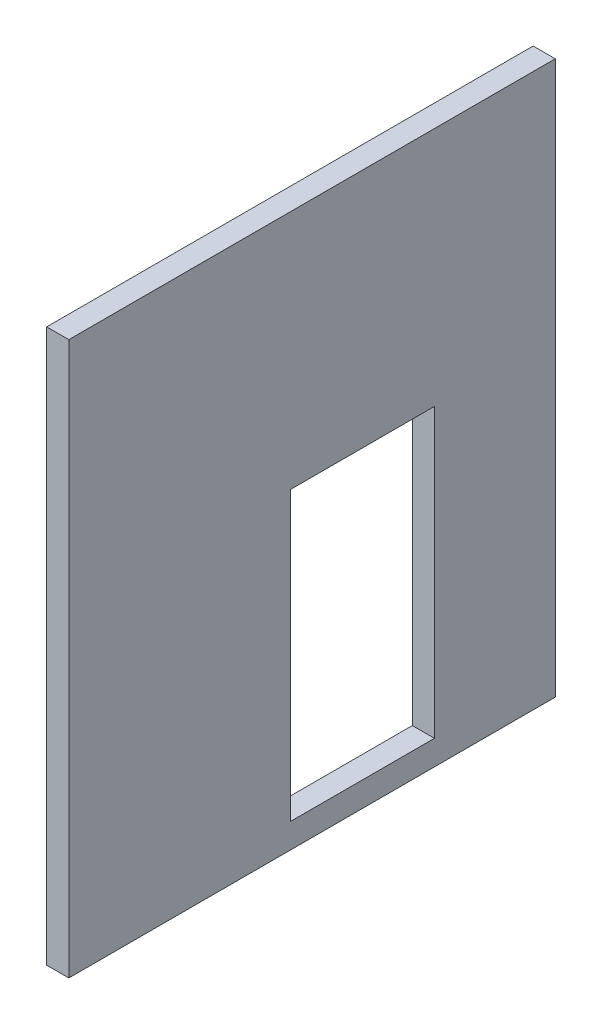
ISO-10303-21;
HEADER;
FILE_DESCRIPTION(('STEP AP214'),'2;1');
FILE_NAME('part.step','',(''),(''),'','','');
FILE_SCHEMA(('AUTOMOTIVE_DESIGN { 1 0 10303 214 1 1 1 1 }'));
ENDSEC;
DATA;
#1=APPLICATION_CONTEXT('core data for automotive mechanical design processes');
#2=APPLICATION_PROTOCOL_DEFINITION('international standard','automotive_design',2000,#1);
#3=PRODUCT_CONTEXT('',#1,'mechanical');
#4=PRODUCT('Part','Part','',(#3));
#5=PRODUCT_RELATED_PRODUCT_CATEGORY('part','',(#4));
#6=PRODUCT_DEFINITION_FORMATION('','',#4);
#7=PRODUCT_DEFINITION_CONTEXT('part definition',#1,'design');
#8=PRODUCT_DEFINITION('design','',#6,#7);
#9=PRODUCT_DEFINITION_SHAPE('','',#8);
#10=(LENGTH_UNIT() NAMED_UNIT(*) SI_UNIT(.MILLI.,.METRE.));
#11=(NAMED_UNIT(*) PLANE_ANGLE_UNIT() SI_UNIT($,.RADIAN.));
#12=(NAMED_UNIT(*) SI_UNIT($,.STERADIAN.) SOLID_ANGLE_UNIT());
#13=UNCERTAINTY_MEASURE_WITH_UNIT(LENGTH_MEASURE(1.E-05),#10,'distance_accuracy_value','');
#14=(GEOMETRIC_REPRESENTATION_CONTEXT(3) GLOBAL_UNCERTAINTY_ASSIGNED_CONTEXT((#13)) GLOBAL_UNIT_ASSIGNED_CONTEXT((#10,
#11,#12)) REPRESENTATION_CONTEXT('',''));
#15=CARTESIAN_POINT('',(0.,0.,0.));
#16=DIRECTION('',(0.,0.,1.));
#17=DIRECTION('',(1.,0.,0.));
#18=AXIS2_PLACEMENT_3D('',#15,#16,#17);
#19=CARTESIAN_POINT('',(20.,-250.,-220.));
#20=DIRECTION('',(0.,0.,1.));
#21=DIRECTION('',(1.,0.,0.));
#22=AXIS2_PLACEMENT_3D('',#19,#20,#21);
#23=PLANE('',#22);
#24=DIRECTION('',(0.,1.,0.));
#25=VECTOR('',#24,1.);
#26=CARTESIAN_POINT('',(0.,-250.,-220.));
#27=LINE('',#26,#25);
#28=CARTESIAN_POINT('',(0.,-250.,-220.));
#29=VERTEX_POINT('',#28);
#30=CARTESIAN_POINT('',(0.,250.,-220.));
#31=VERTEX_POINT('',#30);
#32=EDGE_CURVE('E134',#29,#31,#27,.T.);
#33=ORIENTED_EDGE('',*,*,#32,.T.);
#34=DIRECTION('',(-1.,0.,0.));
#35=VECTOR('',#34,1.);
#36=CARTESIAN_POINT('',(20.,250.,-220.));
#37=LINE('',#36,#35);
#38=CARTESIAN_POINT('',(20.,250.,-220.));
#39=VERTEX_POINT('',#38);
#40=EDGE_CURVE('E11',#39,#31,#37,.T.);
#41=ORIENTED_EDGE('',*,*,#40,.F.);
#42=DIRECTION('',(0.,1.,0.));
#43=VECTOR('',#42,1.);
#44=CARTESIAN_POINT('',(20.,-250.,-220.));
#45=LINE('',#44,#43);
#46=CARTESIAN_POINT('',(20.,-250.,-220.));
#47=VERTEX_POINT('',#46);
#48=EDGE_CURVE('E138',#47,#39,#45,.T.);
#49=ORIENTED_EDGE('',*,*,#48,.F.);
#50=DIRECTION('',(-1.,0.,0.));
#51=VECTOR('',#50,1.);
#52=CARTESIAN_POINT('',(20.,-250.,-220.));
#53=LINE('',#52,#51);
#54=EDGE_CURVE('E148',#47,#29,#53,.T.);
#55=ORIENTED_EDGE('',*,*,#54,.T.);
#56=EDGE_LOOP('',(#33,#41,#49,#55));
#57=FACE_BOUND('',#56,.T.);
#58=ADVANCED_FACE('F37',(#57),#23,.F.);
#59=CARTESIAN_POINT('',(20.,250.,220.));
#60=DIRECTION('',(0.,-1.,0.));
#61=DIRECTION('',(0.,0.,-1.));
#62=AXIS2_PLACEMENT_3D('',#59,#60,#61);
#63=PLANE('',#62);
#64=DIRECTION('',(0.,0.,1.));
#65=VECTOR('',#64,1.);
#66=CARTESIAN_POINT('',(0.,250.,220.));
#67=LINE('',#66,#65);
#68=CARTESIAN_POINT('',(0.,250.,220.));
#69=VERTEX_POINT('',#68);
#70=EDGE_CURVE('E151',#31,#69,#67,.T.);
#71=ORIENTED_EDGE('',*,*,#70,.T.);
#72=DIRECTION('',(-1.,0.,0.));
#73=VECTOR('',#72,1.);
#74=CARTESIAN_POINT('',(20.,250.,220.));
#75=LINE('',#74,#73);
#76=CARTESIAN_POINT('',(20.,250.,220.));
#77=VERTEX_POINT('',#76);
#78=EDGE_CURVE('E44',#77,#69,#75,.T.);
#79=ORIENTED_EDGE('',*,*,#78,.F.);
#80=DIRECTION('',(0.,0.,1.));
#81=VECTOR('',#80,1.);
#82=CARTESIAN_POINT('',(20.,250.,220.));
#83=LINE('',#82,#81);
#84=EDGE_CURVE('E141',#39,#77,#83,.T.);
#85=ORIENTED_EDGE('',*,*,#84,.F.);
#86=ORIENTED_EDGE('',*,*,#40,.T.);
#87=EDGE_LOOP('',(#71,#79,#85,#86));
#88=FACE_BOUND('',#87,.T.);
#89=ADVANCED_FACE('F179',(#88),#63,.F.);
#90=CARTESIAN_POINT('',(20.,-250.,220.));
#91=DIRECTION('',(0.,0.,-1.));
#92=DIRECTION('',(-1.,0.,0.));
#93=AXIS2_PLACEMENT_3D('',#90,#91,#92);
#94=PLANE('',#93);
#95=DIRECTION('',(0.,-1.,0.));
#96=VECTOR('',#95,1.);
#97=CARTESIAN_POINT('',(0.,-250.,220.));
#98=LINE('',#97,#96);
#99=CARTESIAN_POINT('',(0.,-250.,220.));
#100=VERTEX_POINT('',#99);
#101=EDGE_CURVE('E153',#69,#100,#98,.T.);
#102=ORIENTED_EDGE('',*,*,#101,.T.);
#103=DIRECTION('',(-1.,0.,0.));
#104=VECTOR('',#103,1.);
#105=CARTESIAN_POINT('',(20.,-250.,220.));
#106=LINE('',#105,#104);
#107=CARTESIAN_POINT('',(20.,-250.,220.));
#108=VERTEX_POINT('',#107);
#109=EDGE_CURVE('E158',#108,#100,#106,.T.);
#110=ORIENTED_EDGE('',*,*,#109,.F.);
#111=DIRECTION('',(0.,-1.,0.));
#112=VECTOR('',#111,1.);
#113=CARTESIAN_POINT('',(20.,-250.,220.));
#114=LINE('',#113,#112);
#115=EDGE_CURVE('E144',#77,#108,#114,.T.);
#116=ORIENTED_EDGE('',*,*,#115,.F.);
#117=ORIENTED_EDGE('',*,*,#78,.T.);
#118=EDGE_LOOP('',(#102,#110,#116,#117));
#119=FACE_BOUND('',#118,.T.);
#120=ADVANCED_FACE('F165',(#119),#94,.F.);
#121=CARTESIAN_POINT('',(20.,-250.,220.));
#122=DIRECTION('',(0.,1.,0.));
#123=DIRECTION('',(0.,0.,1.));
#124=AXIS2_PLACEMENT_3D('',#121,#122,#123);
#125=PLANE('',#124);
#126=DIRECTION('',(0.,0.,-1.));
#127=VECTOR('',#126,1.);
#128=CARTESIAN_POINT('',(0.,-250.,220.));
#129=LINE('',#128,#127);
#130=EDGE_CURVE('E142',#100,#29,#129,.T.);
#131=ORIENTED_EDGE('',*,*,#130,.T.);
#132=ORIENTED_EDGE('',*,*,#54,.F.);
#133=DIRECTION('',(0.,0.,-1.));
#134=VECTOR('',#133,1.);
#135=CARTESIAN_POINT('',(20.,-250.,220.));
#136=LINE('',#135,#134);
#137=EDGE_CURVE('E146',#108,#47,#136,.T.);
#138=ORIENTED_EDGE('',*,*,#137,.F.);
#139=ORIENTED_EDGE('',*,*,#109,.T.);
#140=EDGE_LOOP('',(#131,#132,#138,#139));
#141=FACE_BOUND('',#140,.T.);
#142=ADVANCED_FACE('F172',(#141),#125,.F.);
#143=CARTESIAN_POINT('',(20.,0.,0.));
#144=DIRECTION('',(-1.,0.,0.));
#145=DIRECTION('',(0.,0.,1.));
#146=AXIS2_PLACEMENT_3D('',#143,#144,#145);
#147=PLANE('',#146);
#148=DIRECTION('',(0.,0.,1.));
#149=VECTOR('',#148,1.);
#150=CARTESIAN_POINT('',(20.,32.3810167112093,-110.664259243724));
#151=LINE('',#150,#149);
#152=CARTESIAN_POINT('',(20.,32.3810167112093,-110.664259243724));
#153=VERTEX_POINT('',#152);
#154=CARTESIAN_POINT('',(20.,32.3810167112092,19.335740756276));
#155=VERTEX_POINT('',#154);
#156=EDGE_CURVE('E128',#153,#155,#151,.T.);
#157=ORIENTED_EDGE('',*,*,#156,.F.);
#158=DIRECTION('',(0.,1.,0.));
#159=VECTOR('',#158,1.);
#160=CARTESIAN_POINT('',(20.,-227.618983288791,-110.664259243724));
#161=LINE('',#160,#159);
#162=CARTESIAN_POINT('',(20.,-227.618983288791,-110.664259243724));
#163=VERTEX_POINT('',#162);
#164=EDGE_CURVE('E51',#163,#153,#161,.T.);
#165=ORIENTED_EDGE('',*,*,#164,.F.);
#166=DIRECTION('',(0.,0.,-1.));
#167=VECTOR('',#166,1.);
#168=CARTESIAN_POINT('',(20.,-227.618983288791,-110.664259243724));
#169=LINE('',#168,#167);
#170=CARTESIAN_POINT('',(20.,-227.618983288791,19.335740756276));
#171=VERTEX_POINT('',#170);
#172=EDGE_CURVE('E119',#171,#163,#169,.T.);
#173=ORIENTED_EDGE('',*,*,#172,.F.);
#174=DIRECTION('',(0.,-1.,0.));
#175=VECTOR('',#174,1.);
#176=CARTESIAN_POINT('',(20.,-227.618983288791,19.335740756276));
#177=LINE('',#176,#175);
#178=EDGE_CURVE('E122',#155,#171,#177,.T.);
#179=ORIENTED_EDGE('',*,*,#178,.F.);
#180=EDGE_LOOP('',(#157,#165,#173,#179));
#181=FACE_BOUND('',#180,.T.);
#182=ORIENTED_EDGE('',*,*,#48,.T.);
#183=ORIENTED_EDGE('',*,*,#84,.T.);
#184=ORIENTED_EDGE('',*,*,#115,.T.);
#185=ORIENTED_EDGE('',*,*,#137,.T.);
#186=EDGE_LOOP('',(#182,#183,#184,#185));
#187=FACE_BOUND('',#186,.T.);
#188=ADVANCED_FACE('F178',(#181,#187),#147,.F.);
#189=CARTESIAN_POINT('',(0.,0.,0.));
#190=DIRECTION('',(-1.,0.,0.));
#191=DIRECTION('',(0.,0.,1.));
#192=AXIS2_PLACEMENT_3D('',#189,#190,#191);
#193=PLANE('',#192);
#194=DIRECTION('',(0.,1.,0.));
#195=VECTOR('',#194,1.);
#196=CARTESIAN_POINT('',(0.,-227.618983288791,-110.664259243724));
#197=LINE('',#196,#195);
#198=CARTESIAN_POINT('',(0.,-227.618983288791,-110.664259243724));
#199=VERTEX_POINT('',#198);
#200=CARTESIAN_POINT('',(0.,32.3810167112093,-110.664259243724));
#201=VERTEX_POINT('',#200);
#202=EDGE_CURVE('E103',#199,#201,#197,.T.);
#203=ORIENTED_EDGE('',*,*,#202,.T.);
#204=DIRECTION('',(0.,0.,1.));
#205=VECTOR('',#204,1.);
#206=CARTESIAN_POINT('',(0.,32.3810167112093,-110.664259243724));
#207=LINE('',#206,#205);
#208=CARTESIAN_POINT('',(0.,32.3810167112092,19.335740756276));
#209=VERTEX_POINT('',#208);
#210=EDGE_CURVE('E112',#201,#209,#207,.T.);
#211=ORIENTED_EDGE('',*,*,#210,.T.);
#212=DIRECTION('',(0.,-1.,0.));
#213=VECTOR('',#212,1.);
#214=CARTESIAN_POINT('',(0.,-227.618983288791,19.335740756276));
#215=LINE('',#214,#213);
#216=CARTESIAN_POINT('',(0.,-227.618983288791,19.335740756276));
#217=VERTEX_POINT('',#216);
#218=EDGE_CURVE('E59',#209,#217,#215,.T.);
#219=ORIENTED_EDGE('',*,*,#218,.T.);
#220=DIRECTION('',(0.,0.,-1.));
#221=VECTOR('',#220,1.);
#222=CARTESIAN_POINT('',(0.,-227.618983288791,-110.664259243724));
#223=LINE('',#222,#221);
#224=EDGE_CURVE('E109',#217,#199,#223,.T.);
#225=ORIENTED_EDGE('',*,*,#224,.T.);
#226=EDGE_LOOP('',(#203,#211,#219,#225));
#227=FACE_BOUND('',#226,.T.);
#228=ORIENTED_EDGE('',*,*,#32,.F.);
#229=ORIENTED_EDGE('',*,*,#130,.F.);
#230=ORIENTED_EDGE('',*,*,#101,.F.);
#231=ORIENTED_EDGE('',*,*,#70,.F.);
#232=EDGE_LOOP('',(#228,#229,#230,#231));
#233=FACE_BOUND('',#232,.T.);
#234=ADVANCED_FACE('F116',(#227,#233),#193,.T.);
#235=CARTESIAN_POINT('',(0.,-227.618983288791,-110.664259243724));
#236=DIRECTION('',(0.,0.,-1.));
#237=DIRECTION('',(-1.,0.,0.));
#238=AXIS2_PLACEMENT_3D('',#235,#236,#237);
#239=PLANE('',#238);
#240=ORIENTED_EDGE('',*,*,#164,.T.);
#241=DIRECTION('',(1.,0.,0.));
#242=VECTOR('',#241,1.);
#243=CARTESIAN_POINT('',(0.,32.3810167112093,-110.664259243724));
#244=LINE('',#243,#242);
#245=EDGE_CURVE('E99',#201,#153,#244,.T.);
#246=ORIENTED_EDGE('',*,*,#245,.F.);
#247=ORIENTED_EDGE('',*,*,#202,.F.);
#248=DIRECTION('',(1.,0.,0.));
#249=VECTOR('',#248,1.);
#250=CARTESIAN_POINT('',(0.,-227.618983288791,-110.664259243724));
#251=LINE('',#250,#249);
#252=EDGE_CURVE('E132',#199,#163,#251,.T.);
#253=ORIENTED_EDGE('',*,*,#252,.T.);
#254=EDGE_LOOP('',(#240,#246,#247,#253));
#255=FACE_BOUND('',#254,.T.);
#256=ADVANCED_FACE('F101',(#255),#239,.F.);
#257=CARTESIAN_POINT('',(0.,-227.618983288791,-110.664259243724));
#258=DIRECTION('',(0.,-1.,0.));
#259=DIRECTION('',(0.,0.,-1.));
#260=AXIS2_PLACEMENT_3D('',#257,#258,#259);
#261=PLANE('',#260);
#262=ORIENTED_EDGE('',*,*,#172,.T.);
#263=ORIENTED_EDGE('',*,*,#252,.F.);
#264=ORIENTED_EDGE('',*,*,#224,.F.);
#265=DIRECTION('',(1.,0.,0.));
#266=VECTOR('',#265,1.);
#267=CARTESIAN_POINT('',(0.,-227.618983288791,19.335740756276));
#268=LINE('',#267,#266);
#269=EDGE_CURVE('E135',#217,#171,#268,.T.);
#270=ORIENTED_EDGE('',*,*,#269,.T.);
#271=EDGE_LOOP('',(#262,#263,#264,#270));
#272=FACE_BOUND('',#271,.T.);
#273=ADVANCED_FACE('F196',(#272),#261,.F.);
#274=CARTESIAN_POINT('',(0.,-227.618983288791,19.335740756276));
#275=DIRECTION('',(0.,0.,1.));
#276=DIRECTION('',(1.,0.,0.));
#277=AXIS2_PLACEMENT_3D('',#274,#275,#276);
#278=PLANE('',#277);
#279=ORIENTED_EDGE('',*,*,#178,.T.);
#280=ORIENTED_EDGE('',*,*,#269,.F.);
#281=ORIENTED_EDGE('',*,*,#218,.F.);
#282=DIRECTION('',(1.,0.,0.));
#283=VECTOR('',#282,1.);
#284=CARTESIAN_POINT('',(0.,32.3810167112092,19.335740756276));
#285=LINE('',#284,#283);
#286=EDGE_CURVE('E108',#209,#155,#285,.T.);
#287=ORIENTED_EDGE('',*,*,#286,.T.);
#288=EDGE_LOOP('',(#279,#280,#281,#287));
#289=FACE_BOUND('',#288,.T.);
#290=ADVANCED_FACE('F199',(#289),#278,.F.);
#291=CARTESIAN_POINT('',(0.,32.3810167112093,-110.664259243724));
#292=DIRECTION('',(0.,1.,0.));
#293=DIRECTION('',(0.,0.,1.));
#294=AXIS2_PLACEMENT_3D('',#291,#292,#293);
#295=PLANE('',#294);
#296=ORIENTED_EDGE('',*,*,#156,.T.);
#297=ORIENTED_EDGE('',*,*,#286,.F.);
#298=ORIENTED_EDGE('',*,*,#210,.F.);
#299=ORIENTED_EDGE('',*,*,#245,.T.);
#300=EDGE_LOOP('',(#296,#297,#298,#299));
#301=FACE_BOUND('',#300,.T.);
#302=ADVANCED_FACE('F113',(#301),#295,.F.);
#303=CLOSED_SHELL('',(#58,#89,#120,#142,#188,#234,#256,#273,#290,#302));
#304=MANIFOLD_SOLID_BREP('B2',#303);
#305=ADVANCED_BREP_SHAPE_REPRESENTATION('',(#18,#304),#14);
#306=SHAPE_DEFINITION_REPRESENTATION(#9,#305);
ENDSEC;
END-ISO-10303-21;
